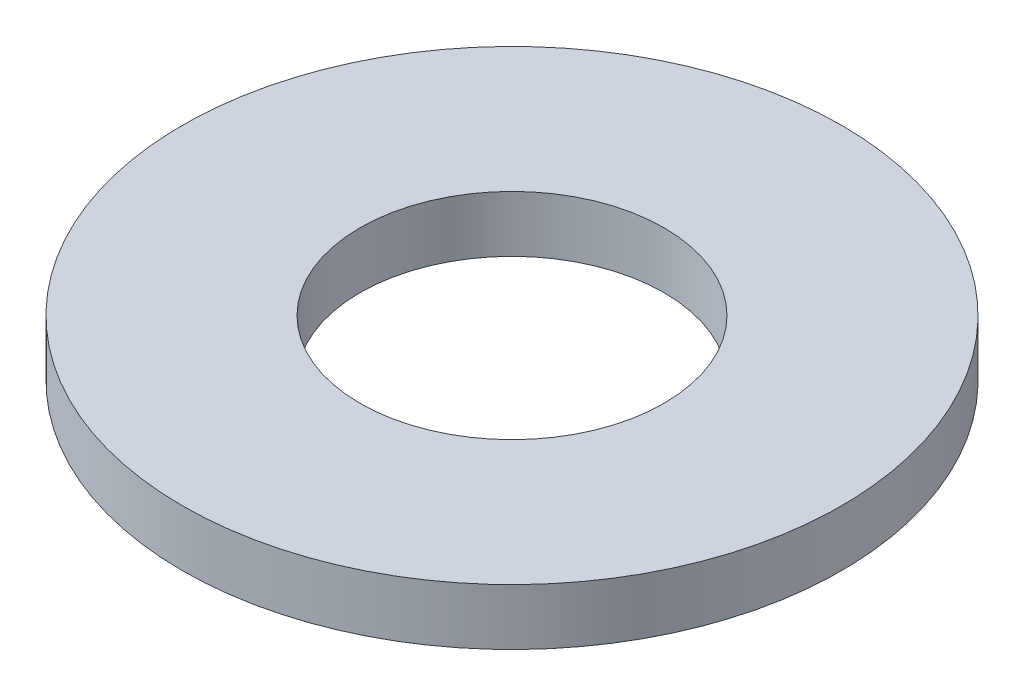
ISO-10303-21;
HEADER;
FILE_DESCRIPTION(('STEP AP214'),'2;1');
FILE_NAME('part.step','',(''),(''),'','','');
FILE_SCHEMA(('AUTOMOTIVE_DESIGN { 1 0 10303 214 1 1 1 1 }'));
ENDSEC;
DATA;
#1=APPLICATION_CONTEXT('core data for automotive mechanical design processes');
#2=APPLICATION_PROTOCOL_DEFINITION('international standard','automotive_design',2000,#1);
#3=PRODUCT_CONTEXT('',#1,'mechanical');
#4=PRODUCT('Part','Part','',(#3));
#5=PRODUCT_RELATED_PRODUCT_CATEGORY('part','',(#4));
#6=PRODUCT_DEFINITION_FORMATION('','',#4);
#7=PRODUCT_DEFINITION_CONTEXT('part definition',#1,'design');
#8=PRODUCT_DEFINITION('design','',#6,#7);
#9=PRODUCT_DEFINITION_SHAPE('','',#8);
#10=(LENGTH_UNIT() NAMED_UNIT(*) SI_UNIT(.MILLI.,.METRE.));
#11=(NAMED_UNIT(*) PLANE_ANGLE_UNIT() SI_UNIT($,.RADIAN.));
#12=(NAMED_UNIT(*) SI_UNIT($,.STERADIAN.) SOLID_ANGLE_UNIT());
#13=UNCERTAINTY_MEASURE_WITH_UNIT(LENGTH_MEASURE(1.E-05),#10,'distance_accuracy_value','');
#14=(GEOMETRIC_REPRESENTATION_CONTEXT(3) GLOBAL_UNCERTAINTY_ASSIGNED_CONTEXT((#13)) GLOBAL_UNIT_ASSIGNED_CONTEXT((#10,
#11,#12)) REPRESENTATION_CONTEXT('',''));
#15=CARTESIAN_POINT('',(0.,0.,0.));
#16=DIRECTION('',(0.,0.,1.));
#17=DIRECTION('',(1.,0.,0.));
#18=AXIS2_PLACEMENT_3D('',#15,#16,#17);
#19=CARTESIAN_POINT('',(0.,0.8128,0.));
#20=DIRECTION('',(0.,1.,0.));
#21=DIRECTION('',(0.,0.,1.));
#22=AXIS2_PLACEMENT_3D('',#19,#20,#21);
#23=PLANE('',#22);
#24=CARTESIAN_POINT('',(0.,0.8128,0.));
#25=DIRECTION('',(0.,-1.,0.));
#26=DIRECTION('',(0.,0.,-1.));
#27=AXIS2_PLACEMENT_3D('',#24,#25,#26);
#28=CIRCLE('',#27,2.1971);
#29=CARTESIAN_POINT('',(0.,0.8128,-2.1971));
#30=VERTEX_POINT('',#29);
#31=EDGE_CURVE('E26',#30,#30,#28,.T.);
#32=ORIENTED_EDGE('',*,*,#31,.T.);
#33=EDGE_LOOP('',(#32));
#34=FACE_BOUND('',#33,.T.);
#35=CARTESIAN_POINT('',(0.,0.8128,0.));
#36=DIRECTION('',(0.,-1.,0.));
#37=DIRECTION('',(0.,0.,-1.));
#38=AXIS2_PLACEMENT_3D('',#35,#36,#37);
#39=CIRCLE('',#38,4.7625);
#40=CARTESIAN_POINT('',(0.,0.8128,-4.7625));
#41=VERTEX_POINT('',#40);
#42=EDGE_CURVE('E17',#41,#41,#39,.T.);
#43=ORIENTED_EDGE('',*,*,#42,.F.);
#44=EDGE_LOOP('',(#43));
#45=FACE_BOUND('',#44,.T.);
#46=ADVANCED_FACE('F14',(#34,#45),#23,.T.);
#47=CARTESIAN_POINT('',(0.,0.8128,0.));
#48=DIRECTION('',(0.,-1.,0.));
#49=DIRECTION('',(0.,0.,-1.));
#50=AXIS2_PLACEMENT_3D('',#47,#48,#49);
#51=CYLINDRICAL_SURFACE('',#50,4.7625);
#52=ORIENTED_EDGE('',*,*,#42,.T.);
#53=EDGE_LOOP('',(#52));
#54=FACE_BOUND('',#53,.T.);
#55=CARTESIAN_POINT('',(0.,0.,0.));
#56=DIRECTION('',(0.,-1.,0.));
#57=DIRECTION('',(0.,0.,-1.));
#58=AXIS2_PLACEMENT_3D('',#55,#56,#57);
#59=CIRCLE('',#58,4.7625);
#60=CARTESIAN_POINT('',(0.,0.,-4.7625));
#61=VERTEX_POINT('',#60);
#62=EDGE_CURVE('E21',#61,#61,#59,.F.);
#63=ORIENTED_EDGE('',*,*,#62,.T.);
#64=EDGE_LOOP('',(#63));
#65=FACE_BOUND('',#64,.T.);
#66=ADVANCED_FACE('F34',(#54,#65),#51,.T.);
#67=CARTESIAN_POINT('',(0.,0.8128,0.));
#68=DIRECTION('',(0.,-1.,0.));
#69=DIRECTION('',(0.,0.,-1.));
#70=AXIS2_PLACEMENT_3D('',#67,#68,#69);
#71=CYLINDRICAL_SURFACE('',#70,2.1971);
#72=CARTESIAN_POINT('',(0.,0.,0.));
#73=DIRECTION('',(0.,-1.,0.));
#74=DIRECTION('',(0.,0.,-1.));
#75=AXIS2_PLACEMENT_3D('',#72,#73,#74);
#76=CIRCLE('',#75,2.1971);
#77=CARTESIAN_POINT('',(0.,0.,-2.1971));
#78=VERTEX_POINT('',#77);
#79=EDGE_CURVE('E8',#78,#78,#76,.T.);
#80=ORIENTED_EDGE('',*,*,#79,.T.);
#81=EDGE_LOOP('',(#80));
#82=FACE_BOUND('',#81,.T.);
#83=ORIENTED_EDGE('',*,*,#31,.F.);
#84=EDGE_LOOP('',(#83));
#85=FACE_BOUND('',#84,.T.);
#86=ADVANCED_FACE('F41',(#82,#85),#71,.F.);
#87=CARTESIAN_POINT('',(0.,0.,0.));
#88=DIRECTION('',(0.,1.,0.));
#89=DIRECTION('',(0.,0.,1.));
#90=AXIS2_PLACEMENT_3D('',#87,#88,#89);
#91=PLANE('',#90);
#92=ORIENTED_EDGE('',*,*,#79,.F.);
#93=EDGE_LOOP('',(#92));
#94=FACE_BOUND('',#93,.T.);
#95=ORIENTED_EDGE('',*,*,#62,.F.);
#96=EDGE_LOOP('',(#95));
#97=FACE_BOUND('',#96,.T.);
#98=ADVANCED_FACE('F42',(#94,#97),#91,.F.);
#99=CLOSED_SHELL('',(#46,#66,#86,#98));
#100=MANIFOLD_SOLID_BREP('B1',#99);
#101=ADVANCED_BREP_SHAPE_REPRESENTATION('',(#18,#100),#14);
#102=SHAPE_DEFINITION_REPRESENTATION(#9,#101);
ENDSEC;
END-ISO-10303-21;
